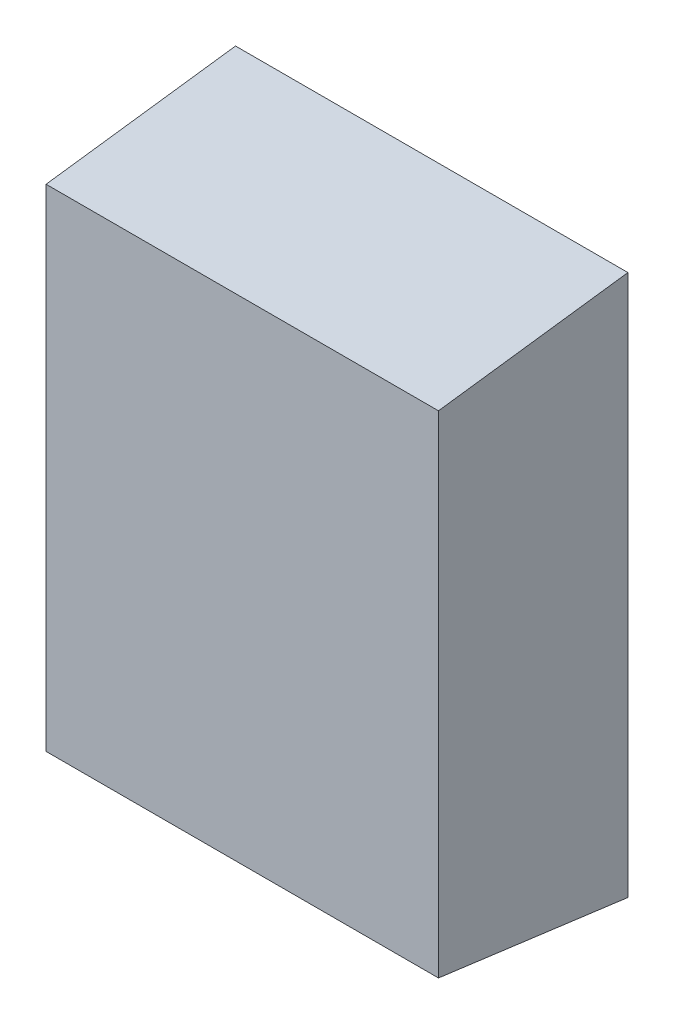
ISO-10303-21;
HEADER;
FILE_DESCRIPTION(('STEP AP214'),'2;1');
FILE_NAME('part.step','',(''),(''),'','','');
FILE_SCHEMA(('AUTOMOTIVE_DESIGN { 1 0 10303 214 1 1 1 1 }'));
ENDSEC;
DATA;
#1=APPLICATION_CONTEXT('core data for automotive mechanical design processes');
#2=APPLICATION_PROTOCOL_DEFINITION('international standard','automotive_design',2000,#1);
#3=PRODUCT_CONTEXT('',#1,'mechanical');
#4=PRODUCT('Part','Part','',(#3));
#5=PRODUCT_RELATED_PRODUCT_CATEGORY('part','',(#4));
#6=PRODUCT_DEFINITION_FORMATION('','',#4);
#7=PRODUCT_DEFINITION_CONTEXT('part definition',#1,'design');
#8=PRODUCT_DEFINITION('design','',#6,#7);
#9=PRODUCT_DEFINITION_SHAPE('','',#8);
#10=(LENGTH_UNIT() NAMED_UNIT(*) SI_UNIT(.MILLI.,.METRE.));
#11=(NAMED_UNIT(*) PLANE_ANGLE_UNIT() SI_UNIT($,.RADIAN.));
#12=(NAMED_UNIT(*) SI_UNIT($,.STERADIAN.) SOLID_ANGLE_UNIT());
#13=UNCERTAINTY_MEASURE_WITH_UNIT(LENGTH_MEASURE(1.E-05),#10,'distance_accuracy_value','');
#14=(GEOMETRIC_REPRESENTATION_CONTEXT(3) GLOBAL_UNCERTAINTY_ASSIGNED_CONTEXT((#13)) GLOBAL_UNIT_ASSIGNED_CONTEXT((#10,
#11,#12)) REPRESENTATION_CONTEXT('',''));
#15=CARTESIAN_POINT('',(0.,0.,0.));
#16=DIRECTION('',(0.,0.,1.));
#17=DIRECTION('',(1.,0.,0.));
#18=AXIS2_PLACEMENT_3D('',#15,#16,#17);
#19=CARTESIAN_POINT('',(-0.00534350019981917,-0.617441590055831,0.679766421000566));
#20=DIRECTION('',(0.,0.,1.));
#21=DIRECTION('',(1.,0.,0.));
#22=AXIS2_PLACEMENT_3D('',#19,#20,#21);
#23=PLANE('',#22);
#24=DIRECTION('',(1.01196828694583E-13,-1.,0.));
#25=VECTOR('',#24,1.);
#26=CARTESIAN_POINT('',(0.357156499800243,-1.11744159005577,0.679766421000566));
#27=LINE('',#26,#25);
#28=CARTESIAN_POINT('',(0.357156499800169,-0.163641806703372,0.679766421000569));
#29=VERTEX_POINT('',#28);
#30=CARTESIAN_POINT('',(0.357156499800239,-1.0712413734082,0.679766421000566));
#31=VERTEX_POINT('',#30);
#32=EDGE_CURVE('E11',#29,#31,#27,.T.);
#33=ORIENTED_EDGE('',*,*,#32,.F.);
#34=DIRECTION('',(1.,0.,0.));
#35=VECTOR('',#34,1.);
#36=CARTESIAN_POINT('',(0.17590649980011,-0.163641806703391,0.679766421000573));
#37=LINE('',#36,#35);
#38=CARTESIAN_POINT('',(-0.367843500199878,-0.163641806703426,0.679766421000566));
#39=VERTEX_POINT('',#38);
#40=EDGE_CURVE('E24',#39,#29,#37,.T.);
#41=ORIENTED_EDGE('',*,*,#40,.F.);
#42=DIRECTION('',(-1.01196828694583E-13,1.,0.));
#43=VECTOR('',#42,1.);
#44=CARTESIAN_POINT('',(-0.367843500199881,-0.117441590055839,0.679766421000566));
#45=LINE('',#44,#43);
#46=CARTESIAN_POINT('',(-0.367843500199831,-1.07124137340823,0.679766421000569));
#47=VERTEX_POINT('',#46);
#48=EDGE_CURVE('E85',#47,#39,#45,.T.);
#49=ORIENTED_EDGE('',*,*,#48,.F.);
#50=DIRECTION('',(-1.,0.,0.));
#51=VECTOR('',#50,1.);
#52=CARTESIAN_POINT('',(0.175906499800206,-1.07124137340818,0.679766421000569));
#53=LINE('',#52,#51);
#54=EDGE_CURVE('E82',#31,#47,#53,.T.);
#55=ORIENTED_EDGE('',*,*,#54,.F.);
#56=EDGE_LOOP('',(#33,#41,#49,#55));
#57=FACE_BOUND('',#56,.T.);
#58=ADVANCED_FACE('F17',(#57),#23,.T.);
#59=CARTESIAN_POINT('',(-0.367843500199881,-0.117441590055839,0.329766421000566));
#60=DIRECTION('',(-1.,-1.01196828694583E-13,0.));
#61=DIRECTION('',(1.01196828694583E-13,-1.,0.));
#62=AXIS2_PLACEMENT_3D('',#59,#60,#61);
#63=PLANE('',#62);
#64=ORIENTED_EDGE('',*,*,#48,.T.);
#65=DIRECTION('',(0.,-0.130865432220325,0.991400140533472));
#66=VECTOR('',#65,1.);
#67=CARTESIAN_POINT('',(-0.367843500199881,-0.140541698379641,0.504766421000562));
#68=LINE('',#67,#66);
#69=CARTESIAN_POINT('',(-0.367843500199881,-0.11744159005582,0.329766421000564));
#70=VERTEX_POINT('',#69);
#71=EDGE_CURVE('E80',#70,#39,#68,.T.);
#72=ORIENTED_EDGE('',*,*,#71,.F.);
#73=DIRECTION('',(0.,-1.,0.));
#74=VECTOR('',#73,1.);
#75=CARTESIAN_POINT('',(-0.367843500199881,-0.617441590055831,0.329766421000566));
#76=LINE('',#75,#74);
#77=CARTESIAN_POINT('',(-0.367843500199806,-1.11744159005584,0.329766421000566));
#78=VERTEX_POINT('',#77);
#79=EDGE_CURVE('E70',#70,#78,#76,.T.);
#80=ORIENTED_EDGE('',*,*,#79,.T.);
#81=DIRECTION('',(0.,-0.130865432220325,-0.991400140533472));
#82=VECTOR('',#81,1.);
#83=CARTESIAN_POINT('',(-0.367843500199785,-1.09434148173204,0.504766421000576));
#84=LINE('',#83,#82);
#85=EDGE_CURVE('E76',#47,#78,#84,.T.);
#86=ORIENTED_EDGE('',*,*,#85,.F.);
#87=EDGE_LOOP('',(#64,#72,#80,#86));
#88=FACE_BOUND('',#87,.T.);
#89=ADVANCED_FACE('F89',(#88),#63,.T.);
#90=CARTESIAN_POINT('',(0.175906499800206,-1.09434148173198,0.504766421000569));
#91=DIRECTION('',(1.00326550189351E-13,-0.991400140533472,0.130865432220325));
#92=DIRECTION('',(0.,-0.130865432220325,-0.991400140533472));
#93=AXIS2_PLACEMENT_3D('',#90,#91,#92);
#94=PLANE('',#93);
#95=ORIENTED_EDGE('',*,*,#85,.T.);
#96=DIRECTION('',(1.,0.,0.));
#97=VECTOR('',#96,1.);
#98=CARTESIAN_POINT('',(-0.00534350019981917,-1.11744159005584,0.329766421000566));
#99=LINE('',#98,#97);
#100=CARTESIAN_POINT('',(0.357156499800243,-1.11744159005579,0.329766421000562));
#101=VERTEX_POINT('',#100);
#102=EDGE_CURVE('E74',#78,#101,#99,.T.);
#103=ORIENTED_EDGE('',*,*,#102,.T.);
#104=DIRECTION('',(0.,-0.130865432220323,-0.991400140533472));
#105=VECTOR('',#104,1.);
#106=CARTESIAN_POINT('',(0.357156499800238,-1.07124137340816,0.679766421000566));
#107=LINE('',#106,#105);
#108=EDGE_CURVE('E57',#31,#101,#107,.T.);
#109=ORIENTED_EDGE('',*,*,#108,.F.);
#110=ORIENTED_EDGE('',*,*,#54,.T.);
#111=EDGE_LOOP('',(#95,#103,#109,#110));
#112=FACE_BOUND('',#111,.T.);
#113=ADVANCED_FACE('F91',(#112),#94,.T.);
#114=CARTESIAN_POINT('',(0.357156499800243,-1.11744159005577,0.329766421000566));
#115=DIRECTION('',(1.,1.01196828694583E-13,0.));
#116=DIRECTION('',(-1.01196828694583E-13,1.,0.));
#117=AXIS2_PLACEMENT_3D('',#114,#115,#116);
#118=PLANE('',#117);
#119=DIRECTION('',(0.,1.,0.));
#120=VECTOR('',#119,1.);
#121=CARTESIAN_POINT('',(0.357156499800243,-0.617441590055831,0.329766421000566));
#122=LINE('',#121,#120);
#123=CARTESIAN_POINT('',(0.357156499800168,-0.117441590055766,0.329766421000566));
#124=VERTEX_POINT('',#123);
#125=EDGE_CURVE('E52',#101,#124,#122,.T.);
#126=ORIENTED_EDGE('',*,*,#125,.T.);
#127=DIRECTION('',(0.,0.130865432220325,-0.991400140533472));
#128=VECTOR('',#127,1.);
#129=CARTESIAN_POINT('',(0.357156499800146,-0.140541698379569,0.504766421000572));
#130=LINE('',#129,#128);
#131=EDGE_CURVE('E55',#29,#124,#130,.T.);
#132=ORIENTED_EDGE('',*,*,#131,.F.);
#133=ORIENTED_EDGE('',*,*,#32,.T.);
#134=ORIENTED_EDGE('',*,*,#108,.T.);
#135=EDGE_LOOP('',(#126,#132,#133,#134));
#136=FACE_BOUND('',#135,.T.);
#137=ADVANCED_FACE('F54',(#136),#118,.T.);
#138=CARTESIAN_POINT('',(0.17590649980011,-0.140541698379587,0.504766421000569));
#139=DIRECTION('',(-1.00326550189351E-13,0.991400140533472,0.130865432220325));
#140=DIRECTION('',(0.,-0.130865432220325,0.991400140533472));
#141=AXIS2_PLACEMENT_3D('',#138,#139,#140);
#142=PLANE('',#141);
#143=ORIENTED_EDGE('',*,*,#71,.T.);
#144=ORIENTED_EDGE('',*,*,#40,.T.);
#145=ORIENTED_EDGE('',*,*,#131,.T.);
#146=DIRECTION('',(-1.,0.,0.));
#147=VECTOR('',#146,1.);
#148=CARTESIAN_POINT('',(-0.00534350019981917,-0.117441590055766,0.329766421000566));
#149=LINE('',#148,#147);
#150=EDGE_CURVE('E66',#124,#70,#149,.T.);
#151=ORIENTED_EDGE('',*,*,#150,.T.);
#152=EDGE_LOOP('',(#143,#144,#145,#151));
#153=FACE_BOUND('',#152,.T.);
#154=ADVANCED_FACE('F65',(#153),#142,.T.);
#155=CARTESIAN_POINT('',(-0.00534350019981917,-0.617441590055831,0.329766421000566));
#156=DIRECTION('',(0.,0.,1.));
#157=DIRECTION('',(1.,0.,0.));
#158=AXIS2_PLACEMENT_3D('',#155,#156,#157);
#159=PLANE('',#158);
#160=ORIENTED_EDGE('',*,*,#125,.F.);
#161=ORIENTED_EDGE('',*,*,#102,.F.);
#162=ORIENTED_EDGE('',*,*,#79,.F.);
#163=ORIENTED_EDGE('',*,*,#150,.F.);
#164=EDGE_LOOP('',(#160,#161,#162,#163));
#165=FACE_BOUND('',#164,.T.);
#166=ADVANCED_FACE('F69',(#165),#159,.F.);
#167=CLOSED_SHELL('',(#58,#89,#113,#137,#154,#166));
#168=MANIFOLD_SOLID_BREP('B1',#167);
#169=ADVANCED_BREP_SHAPE_REPRESENTATION('',(#18,#168),#14);
#170=SHAPE_DEFINITION_REPRESENTATION(#9,#169);
ENDSEC;
END-ISO-10303-21;
